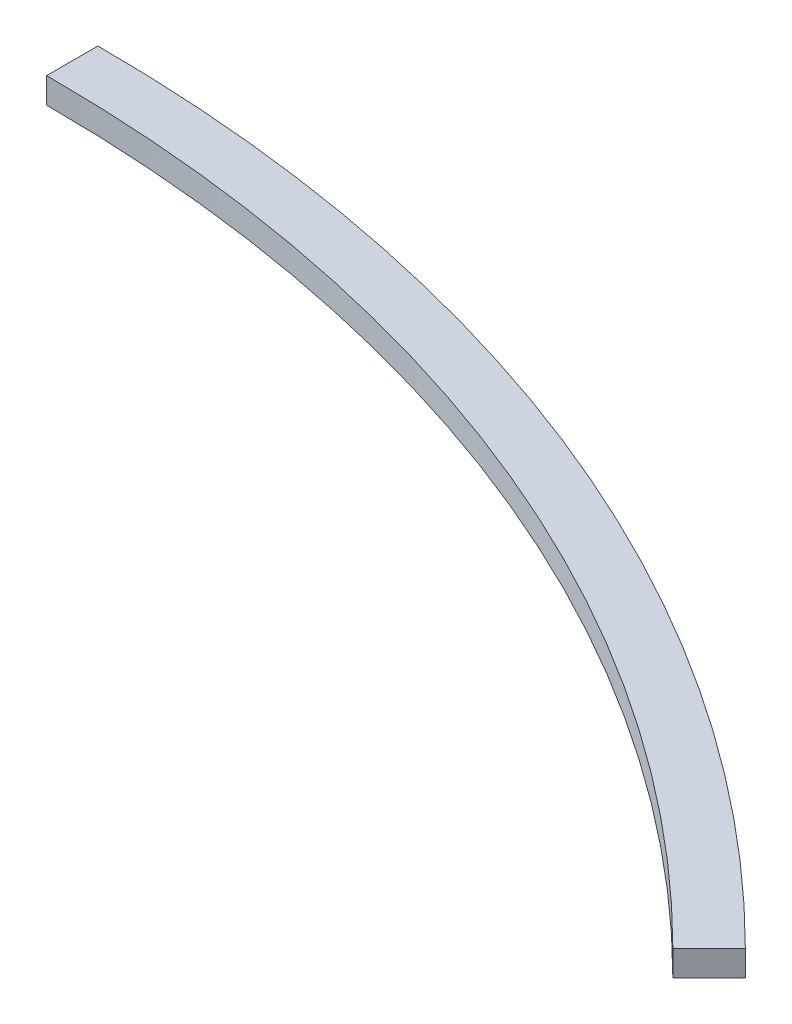
ISO-10303-21;
HEADER;
FILE_DESCRIPTION(('STEP AP214'),'2;1');
FILE_NAME('part.step','',(''),(''),'','','');
FILE_SCHEMA(('AUTOMOTIVE_DESIGN { 1 0 10303 214 1 1 1 1 }'));
ENDSEC;
DATA;
#1=APPLICATION_CONTEXT('core data for automotive mechanical design processes');
#2=APPLICATION_PROTOCOL_DEFINITION('international standard','automotive_design',2000,#1);
#3=PRODUCT_CONTEXT('',#1,'mechanical');
#4=PRODUCT('Part','Part','',(#3));
#5=PRODUCT_RELATED_PRODUCT_CATEGORY('part','',(#4));
#6=PRODUCT_DEFINITION_FORMATION('','',#4);
#7=PRODUCT_DEFINITION_CONTEXT('part definition',#1,'design');
#8=PRODUCT_DEFINITION('design','',#6,#7);
#9=PRODUCT_DEFINITION_SHAPE('','',#8);
#10=(LENGTH_UNIT() NAMED_UNIT(*) SI_UNIT(.MILLI.,.METRE.));
#11=(NAMED_UNIT(*) PLANE_ANGLE_UNIT() SI_UNIT($,.RADIAN.));
#12=(NAMED_UNIT(*) SI_UNIT($,.STERADIAN.) SOLID_ANGLE_UNIT());
#13=UNCERTAINTY_MEASURE_WITH_UNIT(LENGTH_MEASURE(1.E-05),#10,'distance_accuracy_value','');
#14=(GEOMETRIC_REPRESENTATION_CONTEXT(3) GLOBAL_UNCERTAINTY_ASSIGNED_CONTEXT((#13)) GLOBAL_UNIT_ASSIGNED_CONTEXT((#10,
#11,#12)) REPRESENTATION_CONTEXT('',''));
#15=CARTESIAN_POINT('',(0.,0.,0.));
#16=DIRECTION('',(0.,0.,1.));
#17=DIRECTION('',(1.,0.,0.));
#18=AXIS2_PLACEMENT_3D('',#15,#16,#17);
#19=CARTESIAN_POINT('',(0.,10.,0.));
#20=DIRECTION('',(0.,-1.,0.));
#21=DIRECTION('',(0.,0.,-1.));
#22=AXIS2_PLACEMENT_3D('',#19,#20,#21);
#23=CYLINDRICAL_SURFACE('',#22,610.);
#24=CARTESIAN_POINT('',(0.,0.,0.));
#25=DIRECTION('',(0.,1.,0.));
#26=DIRECTION('',(0.,0.,1.));
#27=AXIS2_PLACEMENT_3D('',#24,#25,#26);
#28=CIRCLE('',#27,610.);
#29=CARTESIAN_POINT('',(0.,0.,-610.));
#30=VERTEX_POINT('',#29);
#31=CARTESIAN_POINT('',(431.335136523795,0.,-431.335136523793));
#32=VERTEX_POINT('',#31);
#33=EDGE_CURVE('E97',#30,#32,#28,.F.);
#34=ORIENTED_EDGE('',*,*,#33,.F.);
#35=DIRECTION('',(0.,-1.,0.));
#36=VECTOR('',#35,1.);
#37=CARTESIAN_POINT('',(0.,10.,-610.));
#38=LINE('',#37,#36);
#39=CARTESIAN_POINT('',(0.,10.,-610.));
#40=VERTEX_POINT('',#39);
#41=EDGE_CURVE('E11',#40,#30,#38,.T.);
#42=ORIENTED_EDGE('',*,*,#41,.F.);
#43=CARTESIAN_POINT('',(0.,10.,0.));
#44=DIRECTION('',(0.,1.,0.));
#45=DIRECTION('',(0.,0.,1.));
#46=AXIS2_PLACEMENT_3D('',#43,#44,#45);
#47=CIRCLE('',#46,610.);
#48=CARTESIAN_POINT('',(431.335136523795,10.,-431.335136523793));
#49=VERTEX_POINT('',#48);
#50=EDGE_CURVE('E91',#40,#49,#47,.F.);
#51=ORIENTED_EDGE('',*,*,#50,.T.);
#52=DIRECTION('',(0.,-1.,0.));
#53=VECTOR('',#52,1.);
#54=CARTESIAN_POINT('',(431.335136523795,10.,-431.335136523793));
#55=LINE('',#54,#53);
#56=EDGE_CURVE('E72',#49,#32,#55,.T.);
#57=ORIENTED_EDGE('',*,*,#56,.T.);
#58=EDGE_LOOP('',(#34,#42,#51,#57));
#59=FACE_BOUND('',#58,.T.);
#60=ADVANCED_FACE('F34',(#59),#23,.T.);
#61=CARTESIAN_POINT('',(0.,10.,0.));
#62=DIRECTION('',(-1.,0.,0.));
#63=DIRECTION('',(0.,0.,1.));
#64=AXIS2_PLACEMENT_3D('',#61,#62,#63);
#65=PLANE('',#64);
#66=DIRECTION('',(0.,0.,-1.));
#67=VECTOR('',#66,1.);
#68=CARTESIAN_POINT('',(0.,0.,0.));
#69=LINE('',#68,#67);
#70=CARTESIAN_POINT('',(0.,0.,-590.));
#71=VERTEX_POINT('',#70);
#72=EDGE_CURVE('E85',#71,#30,#69,.T.);
#73=ORIENTED_EDGE('',*,*,#72,.F.);
#74=DIRECTION('',(0.,-1.,0.));
#75=VECTOR('',#74,1.);
#76=CARTESIAN_POINT('',(0.,10.,-590.));
#77=LINE('',#76,#75);
#78=CARTESIAN_POINT('',(0.,10.,-590.));
#79=VERTEX_POINT('',#78);
#80=EDGE_CURVE('E42',#79,#71,#77,.T.);
#81=ORIENTED_EDGE('',*,*,#80,.F.);
#82=DIRECTION('',(0.,0.,-1.));
#83=VECTOR('',#82,1.);
#84=CARTESIAN_POINT('',(0.,10.,0.));
#85=LINE('',#84,#83);
#86=EDGE_CURVE('E83',#79,#40,#85,.T.);
#87=ORIENTED_EDGE('',*,*,#86,.T.);
#88=ORIENTED_EDGE('',*,*,#41,.T.);
#89=EDGE_LOOP('',(#73,#81,#87,#88));
#90=FACE_BOUND('',#89,.T.);
#91=ADVANCED_FACE('F81',(#90),#65,.T.);
#92=CARTESIAN_POINT('',(0.,10.,0.));
#93=DIRECTION('',(0.,-1.,0.));
#94=DIRECTION('',(0.,0.,-1.));
#95=AXIS2_PLACEMENT_3D('',#92,#93,#94);
#96=CYLINDRICAL_SURFACE('',#95,590.);
#97=CARTESIAN_POINT('',(0.,0.,0.));
#98=DIRECTION('',(0.,1.,0.));
#99=DIRECTION('',(0.,0.,1.));
#100=AXIS2_PLACEMENT_3D('',#97,#98,#99);
#101=CIRCLE('',#100,590.);
#102=CARTESIAN_POINT('',(417.193000900064,0.,-417.193000900062));
#103=VERTEX_POINT('',#102);
#104=EDGE_CURVE('E65',#71,#103,#101,.F.);
#105=ORIENTED_EDGE('',*,*,#104,.T.);
#106=DIRECTION('',(0.,-1.,0.));
#107=VECTOR('',#106,1.);
#108=CARTESIAN_POINT('',(417.193000900064,10.,-417.193000900062));
#109=LINE('',#108,#107);
#110=CARTESIAN_POINT('',(417.193000900064,10.,-417.193000900062));
#111=VERTEX_POINT('',#110);
#112=EDGE_CURVE('E86',#111,#103,#109,.T.);
#113=ORIENTED_EDGE('',*,*,#112,.F.);
#114=CARTESIAN_POINT('',(0.,10.,0.));
#115=DIRECTION('',(0.,1.,0.));
#116=DIRECTION('',(0.,0.,1.));
#117=AXIS2_PLACEMENT_3D('',#114,#115,#116);
#118=CIRCLE('',#117,590.);
#119=EDGE_CURVE('E87',#79,#111,#118,.F.);
#120=ORIENTED_EDGE('',*,*,#119,.F.);
#121=ORIENTED_EDGE('',*,*,#80,.T.);
#122=EDGE_LOOP('',(#105,#113,#120,#121));
#123=FACE_BOUND('',#122,.T.);
#124=ADVANCED_FACE('F88',(#123),#96,.F.);
#125=CARTESIAN_POINT('',(-1.05981240961154E-12,10.,-1.05981240961155E-12));
#126=DIRECTION('',(-0.707106781186545,0.,-0.70710678118655));
#127=DIRECTION('',(-0.70710678118655,0.,0.707106781186545));
#128=AXIS2_PLACEMENT_3D('',#125,#126,#127);
#129=PLANE('',#128);
#130=DIRECTION('',(0.70710678118655,0.,-0.707106781186545));
#131=VECTOR('',#130,1.);
#132=CARTESIAN_POINT('',(-1.05981240961154E-12,0.,-1.05981240961155E-12));
#133=LINE('',#132,#131);
#134=EDGE_CURVE('E93',#103,#32,#133,.T.);
#135=ORIENTED_EDGE('',*,*,#134,.T.);
#136=ORIENTED_EDGE('',*,*,#56,.F.);
#137=DIRECTION('',(0.70710678118655,0.,-0.707106781186545));
#138=VECTOR('',#137,1.);
#139=CARTESIAN_POINT('',(-1.05981240961154E-12,10.,-1.05981240961155E-12));
#140=LINE('',#139,#138);
#141=EDGE_CURVE('E50',#111,#49,#140,.T.);
#142=ORIENTED_EDGE('',*,*,#141,.F.);
#143=ORIENTED_EDGE('',*,*,#112,.T.);
#144=EDGE_LOOP('',(#135,#136,#142,#143));
#145=FACE_BOUND('',#144,.T.);
#146=ADVANCED_FACE('F106',(#145),#129,.F.);
#147=CARTESIAN_POINT('',(0.,10.,0.));
#148=DIRECTION('',(0.,1.,0.));
#149=DIRECTION('',(0.,0.,1.));
#150=AXIS2_PLACEMENT_3D('',#147,#148,#149);
#151=PLANE('',#150);
#152=ORIENTED_EDGE('',*,*,#50,.F.);
#153=ORIENTED_EDGE('',*,*,#86,.F.);
#154=ORIENTED_EDGE('',*,*,#119,.T.);
#155=ORIENTED_EDGE('',*,*,#141,.T.);
#156=EDGE_LOOP('',(#152,#153,#154,#155));
#157=FACE_BOUND('',#156,.T.);
#158=ADVANCED_FACE('F90',(#157),#151,.T.);
#159=CARTESIAN_POINT('',(0.,0.,0.));
#160=DIRECTION('',(0.,1.,0.));
#161=DIRECTION('',(0.,0.,1.));
#162=AXIS2_PLACEMENT_3D('',#159,#160,#161);
#163=PLANE('',#162);
#164=ORIENTED_EDGE('',*,*,#33,.T.);
#165=ORIENTED_EDGE('',*,*,#134,.F.);
#166=ORIENTED_EDGE('',*,*,#104,.F.);
#167=ORIENTED_EDGE('',*,*,#72,.T.);
#168=EDGE_LOOP('',(#164,#165,#166,#167));
#169=FACE_BOUND('',#168,.T.);
#170=ADVANCED_FACE('F108',(#169),#163,.F.);
#171=CLOSED_SHELL('',(#60,#91,#124,#146,#158,#170));
#172=MANIFOLD_SOLID_BREP('B2',#171);
#173=ADVANCED_BREP_SHAPE_REPRESENTATION('',(#18,#172),#14);
#174=SHAPE_DEFINITION_REPRESENTATION(#9,#173);
ENDSEC;
END-ISO-10303-21;
